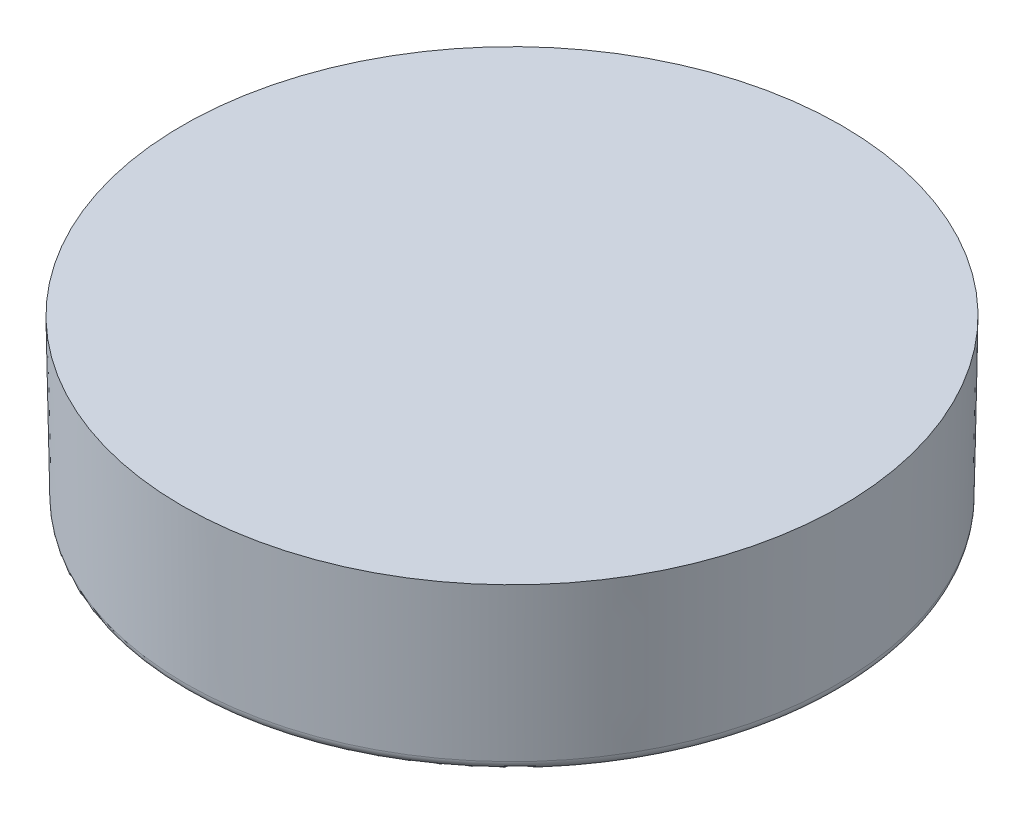
ISO-10303-21;
HEADER;
FILE_DESCRIPTION(('STEP AP214'),'2;1');
FILE_NAME('part.step','',(''),(''),'','','');
FILE_SCHEMA(('AUTOMOTIVE_DESIGN { 1 0 10303 214 1 1 1 1 }'));
ENDSEC;
DATA;
#1=APPLICATION_CONTEXT('core data for automotive mechanical design processes');
#2=APPLICATION_PROTOCOL_DEFINITION('international standard','automotive_design',2000,#1);
#3=PRODUCT_CONTEXT('',#1,'mechanical');
#4=PRODUCT('Part','Part','',(#3));
#5=PRODUCT_RELATED_PRODUCT_CATEGORY('part','',(#4));
#6=PRODUCT_DEFINITION_FORMATION('','',#4);
#7=PRODUCT_DEFINITION_CONTEXT('part definition',#1,'design');
#8=PRODUCT_DEFINITION('design','',#6,#7);
#9=PRODUCT_DEFINITION_SHAPE('','',#8);
#10=(LENGTH_UNIT() NAMED_UNIT(*) SI_UNIT(.MILLI.,.METRE.));
#11=(NAMED_UNIT(*) PLANE_ANGLE_UNIT() SI_UNIT($,.RADIAN.));
#12=(NAMED_UNIT(*) SI_UNIT($,.STERADIAN.) SOLID_ANGLE_UNIT());
#13=UNCERTAINTY_MEASURE_WITH_UNIT(LENGTH_MEASURE(1.E-05),#10,'distance_accuracy_value','');
#14=(GEOMETRIC_REPRESENTATION_CONTEXT(3) GLOBAL_UNCERTAINTY_ASSIGNED_CONTEXT((#13)) GLOBAL_UNIT_ASSIGNED_CONTEXT((#10,
#11,#12)) REPRESENTATION_CONTEXT('',''));
#15=CARTESIAN_POINT('',(0.,0.,0.));
#16=DIRECTION('',(0.,0.,1.));
#17=DIRECTION('',(1.,0.,0.));
#18=AXIS2_PLACEMENT_3D('',#15,#16,#17);
#19=CARTESIAN_POINT('',(0.,0.,0.));
#20=DIRECTION('',(0.,1.,0.));
#21=DIRECTION('',(0.,0.,1.));
#22=AXIS2_PLACEMENT_3D('',#19,#20,#21);
#23=CONICAL_SURFACE('',#22,12.7,0.0174532925199433);
#24=CARTESIAN_POINT('',(0.,-5.9756493668526,0.));
#25=DIRECTION('',(0.,1.,0.));
#26=DIRECTION('',(0.,0.,1.));
#27=AXIS2_PLACEMENT_3D('',#24,#25,#26);
#28=CIRCLE('',#27,12.5956946523133);
#29=CARTESIAN_POINT('',(0.,-5.9756493668526,12.5956946523133));
#30=VERTEX_POINT('',#29);
#31=EDGE_CURVE('E50',#30,#30,#28,.T.);
#32=ORIENTED_EDGE('',*,*,#31,.T.);
#33=EDGE_LOOP('',(#32));
#34=FACE_BOUND('',#33,.T.);
#35=CARTESIAN_POINT('',(0.,0.,0.));
#36=DIRECTION('',(0.,1.,0.));
#37=DIRECTION('',(0.,0.,1.));
#38=AXIS2_PLACEMENT_3D('',#35,#36,#37);
#39=CIRCLE('',#38,12.7);
#40=CARTESIAN_POINT('',(0.,0.,12.7));
#41=VERTEX_POINT('',#40);
#42=EDGE_CURVE('E56',#41,#41,#39,.T.);
#43=ORIENTED_EDGE('',*,*,#42,.F.);
#44=EDGE_LOOP('',(#43));
#45=FACE_BOUND('',#44,.T.);
#46=ADVANCED_FACE('F35',(#34,#45),#23,.T.);
#47=CARTESIAN_POINT('',(0.,0.,0.));
#48=DIRECTION('',(0.,1.,0.));
#49=DIRECTION('',(0.,0.,1.));
#50=AXIS2_PLACEMENT_3D('',#47,#48,#49);
#51=PLANE('',#50);
#52=ORIENTED_EDGE('',*,*,#42,.T.);
#53=EDGE_LOOP('',(#52));
#54=FACE_BOUND('',#53,.T.);
#55=ADVANCED_FACE('F77',(#54),#51,.T.);
#56=CARTESIAN_POINT('',(0.,-2.3114,0.));
#57=DIRECTION('',(0.,-1.,0.));
#58=DIRECTION('',(0.,0.,1.));
#59=AXIS2_PLACEMENT_3D('',#56,#57,#58);
#60=CONICAL_SURFACE('',#59,10.9623456370751,0.174532925199433);
#61=CARTESIAN_POINT('',(0.,-6.03515995569109,0.));
#62=DIRECTION('',(0.,1.,0.));
#63=DIRECTION('',(0.,0.,1.));
#64=AXIS2_PLACEMENT_3D('',#61,#62,#63);
#65=CIRCLE('',#64,11.6189449869452);
#66=CARTESIAN_POINT('',(0.,-6.03515995569109,11.6189449869452));
#67=VERTEX_POINT('',#66);
#68=EDGE_CURVE('E10',#67,#67,#65,.F.);
#69=ORIENTED_EDGE('',*,*,#68,.T.);
#70=EDGE_LOOP('',(#69));
#71=FACE_BOUND('',#70,.T.);
#72=CARTESIAN_POINT('',(0.,-2.3114,0.));
#73=DIRECTION('',(0.,1.,0.));
#74=DIRECTION('',(0.,0.,1.));
#75=AXIS2_PLACEMENT_3D('',#72,#73,#74);
#76=CIRCLE('',#75,10.9623456370751);
#77=CARTESIAN_POINT('',(0.,-2.3114,10.9623456370751));
#78=VERTEX_POINT('',#77);
#79=EDGE_CURVE('E55',#78,#78,#76,.T.);
#80=ORIENTED_EDGE('',*,*,#79,.T.);
#81=EDGE_LOOP('',(#80));
#82=FACE_BOUND('',#81,.T.);
#83=ADVANCED_FACE('F62',(#71,#82),#60,.F.);
#84=CARTESIAN_POINT('',(0.,-6.35,0.));
#85=DIRECTION('',(0.,1.,0.));
#86=DIRECTION('',(0.,0.,1.));
#87=AXIS2_PLACEMENT_3D('',#84,#85,#86);
#88=PLANE('',#87);
#89=CARTESIAN_POINT('',(0.,-6.35,0.));
#90=DIRECTION('',(0.,1.,0.));
#91=DIRECTION('',(0.,0.,1.));
#92=AXIS2_PLACEMENT_3D('',#89,#90,#91);
#93=CIRCLE('',#92,12.2147526804587);
#94=CARTESIAN_POINT('',(0.,-6.35,12.2147526804587));
#95=VERTEX_POINT('',#94);
#96=EDGE_CURVE('E42',#95,#95,#93,.F.);
#97=ORIENTED_EDGE('',*,*,#96,.T.);
#98=EDGE_LOOP('',(#97));
#99=FACE_BOUND('',#98,.T.);
#100=CARTESIAN_POINT('',(0.,-6.35,0.));
#101=DIRECTION('',(0.,1.,0.));
#102=DIRECTION('',(0.,0.,1.));
#103=AXIS2_PLACEMENT_3D('',#100,#101,#102);
#104=CIRCLE('',#103,11.9941567408428);
#105=CARTESIAN_POINT('',(0.,-6.35,11.9941567408428));
#106=VERTEX_POINT('',#105);
#107=EDGE_CURVE('E46',#106,#106,#104,.T.);
#108=ORIENTED_EDGE('',*,*,#107,.T.);
#109=EDGE_LOOP('',(#108));
#110=FACE_BOUND('',#109,.T.);
#111=ADVANCED_FACE('F67',(#99,#110),#88,.F.);
#112=CARTESIAN_POINT('',(0.,-2.3114,0.));
#113=DIRECTION('',(0.,1.,0.));
#114=DIRECTION('',(0.,0.,1.));
#115=AXIS2_PLACEMENT_3D('',#112,#113,#114);
#116=PLANE('',#115);
#117=ORIENTED_EDGE('',*,*,#79,.F.);
#118=EDGE_LOOP('',(#117));
#119=FACE_BOUND('',#118,.T.);
#120=ADVANCED_FACE('F64',(#119),#116,.F.);
#121=CARTESIAN_POINT('',(0.,-5.969,0.));
#122=DIRECTION('',(0.,1.,0.));
#123=DIRECTION('',(0.,0.,1.));
#124=AXIS2_PLACEMENT_3D('',#121,#122,#123);
#125=TOROIDAL_SURFACE('',#124,12.2147526804587,0.381);
#126=ORIENTED_EDGE('',*,*,#96,.F.);
#127=EDGE_LOOP('',(#126));
#128=FACE_BOUND('',#127,.T.);
#129=ORIENTED_EDGE('',*,*,#31,.F.);
#130=EDGE_LOOP('',(#129));
#131=FACE_BOUND('',#130,.T.);
#132=ADVANCED_FACE('F66',(#128,#131),#125,.T.);
#133=CARTESIAN_POINT('',(0.,-5.969,0.));
#134=DIRECTION('',(0.,1.,0.));
#135=DIRECTION('',(0.,0.,1.));
#136=AXIS2_PLACEMENT_3D('',#133,#134,#135);
#137=TOROIDAL_SURFACE('',#136,11.9941567408428,0.381);
#138=ORIENTED_EDGE('',*,*,#68,.F.);
#139=EDGE_LOOP('',(#138));
#140=FACE_BOUND('',#139,.T.);
#141=ORIENTED_EDGE('',*,*,#107,.F.);
#142=EDGE_LOOP('',(#141));
#143=FACE_BOUND('',#142,.T.);
#144=ADVANCED_FACE('F37',(#140,#143),#137,.T.);
#145=CLOSED_SHELL('',(#46,#55,#83,#111,#120,#132,#144));
#146=MANIFOLD_SOLID_BREP('B2',#145);
#147=ADVANCED_BREP_SHAPE_REPRESENTATION('',(#18,#146),#14);
#148=SHAPE_DEFINITION_REPRESENTATION(#9,#147);
ENDSEC;
END-ISO-10303-21;
